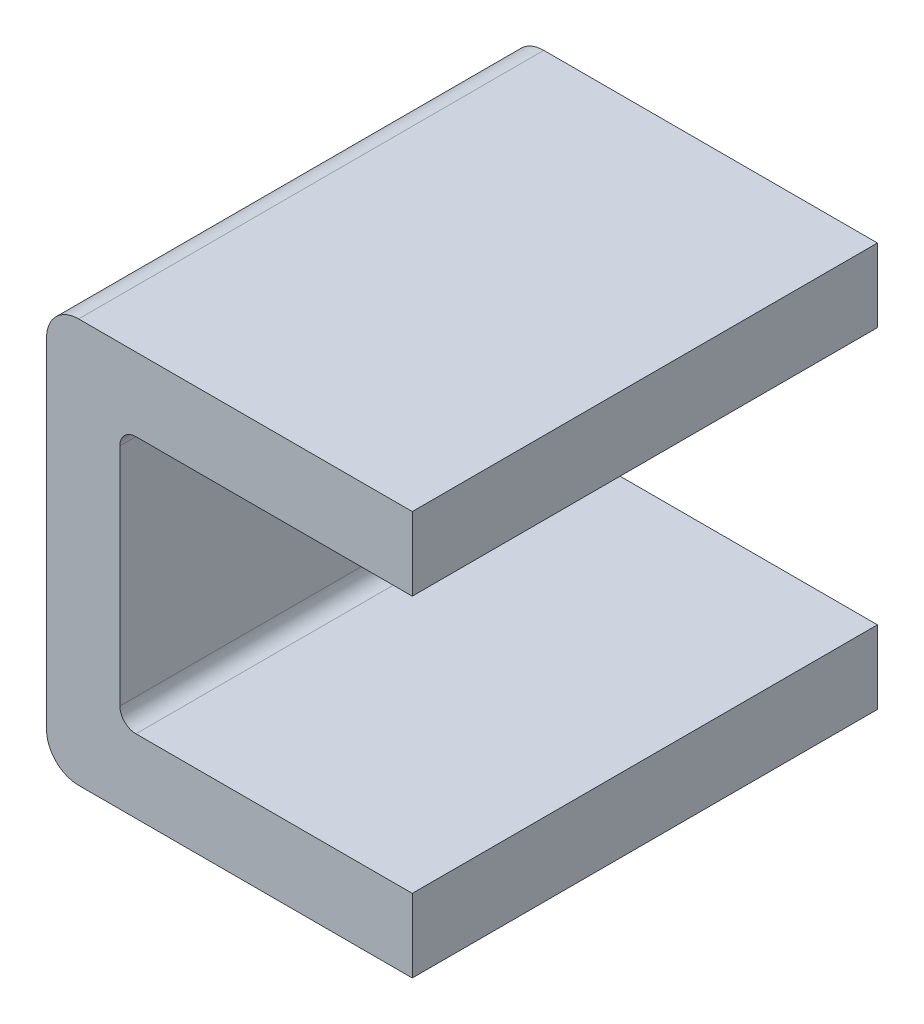
ISO-10303-21;
HEADER;
FILE_DESCRIPTION(('STEP AP214'),'2;1');
FILE_NAME('part.step','',(''),(''),'','','');
FILE_SCHEMA(('AUTOMOTIVE_DESIGN { 1 0 10303 214 1 1 1 1 }'));
ENDSEC;
DATA;
#1=APPLICATION_CONTEXT('core data for automotive mechanical design processes');
#2=APPLICATION_PROTOCOL_DEFINITION('international standard','automotive_design',2000,#1);
#3=PRODUCT_CONTEXT('',#1,'mechanical');
#4=PRODUCT('Part','Part','',(#3));
#5=PRODUCT_RELATED_PRODUCT_CATEGORY('part','',(#4));
#6=PRODUCT_DEFINITION_FORMATION('','',#4);
#7=PRODUCT_DEFINITION_CONTEXT('part definition',#1,'design');
#8=PRODUCT_DEFINITION('design','',#6,#7);
#9=PRODUCT_DEFINITION_SHAPE('','',#8);
#10=(LENGTH_UNIT() NAMED_UNIT(*) SI_UNIT(.MILLI.,.METRE.));
#11=(NAMED_UNIT(*) PLANE_ANGLE_UNIT() SI_UNIT($,.RADIAN.));
#12=(NAMED_UNIT(*) SI_UNIT($,.STERADIAN.) SOLID_ANGLE_UNIT());
#13=UNCERTAINTY_MEASURE_WITH_UNIT(LENGTH_MEASURE(1.E-05),#10,'distance_accuracy_value','');
#14=(GEOMETRIC_REPRESENTATION_CONTEXT(3) GLOBAL_UNCERTAINTY_ASSIGNED_CONTEXT((#13)) GLOBAL_UNIT_ASSIGNED_CONTEXT((#10,
#11,#12)) REPRESENTATION_CONTEXT('',''));
#15=CARTESIAN_POINT('',(0.,0.,0.));
#16=DIRECTION('',(0.,0.,1.));
#17=DIRECTION('',(1.,0.,0.));
#18=AXIS2_PLACEMENT_3D('',#15,#16,#17);
#19=CARTESIAN_POINT('',(0.0500000000000001,1.07149999997381,0.));
#20=DIRECTION('',(0.,0.,1.));
#21=DIRECTION('',(-0.707106781186547,0.707106781186548,0.));
#22=AXIS2_PLACEMENT_3D('',#19,#20,#21);
#23=CYLINDRICAL_SURFACE('',#22,0.05);
#24=CARTESIAN_POINT('',(0.0500000000000001,1.07149999997381,0.));
#25=DIRECTION('',(0.,0.,-1.));
#26=DIRECTION('',(-1.,0.,0.));
#27=AXIS2_PLACEMENT_3D('',#24,#25,#26);
#28=CIRCLE('',#27,0.05);
#29=CARTESIAN_POINT('',(0.,1.07149999997381,0.));
#30=VERTEX_POINT('',#29);
#31=CARTESIAN_POINT('',(0.0500000000000001,1.12149999997381,0.));
#32=VERTEX_POINT('',#31);
#33=EDGE_CURVE('E11',#30,#32,#28,.T.);
#34=ORIENTED_EDGE('',*,*,#33,.T.);
#35=DIRECTION('',(0.,0.,1.));
#36=VECTOR('',#35,1.);
#37=CARTESIAN_POINT('',(0.0500000000000001,1.12149999997381,0.));
#38=LINE('',#37,#36);
#39=CARTESIAN_POINT('',(0.0500000000000001,1.12149999997381,1.45));
#40=VERTEX_POINT('',#39);
#41=EDGE_CURVE('E24',#32,#40,#38,.T.);
#42=ORIENTED_EDGE('',*,*,#41,.T.);
#43=CARTESIAN_POINT('',(0.0500000000000001,1.07149999997381,1.45));
#44=DIRECTION('',(0.,0.,1.));
#45=DIRECTION('',(0.,1.,0.));
#46=AXIS2_PLACEMENT_3D('',#43,#44,#45);
#47=CIRCLE('',#46,0.05);
#48=CARTESIAN_POINT('',(0.,1.07149999997381,1.45));
#49=VERTEX_POINT('',#48);
#50=EDGE_CURVE('E182',#40,#49,#47,.T.);
#51=ORIENTED_EDGE('',*,*,#50,.T.);
#52=DIRECTION('',(0.,0.,-1.));
#53=VECTOR('',#52,1.);
#54=CARTESIAN_POINT('',(0.,1.07149999997381,1.45));
#55=LINE('',#54,#53);
#56=EDGE_CURVE('E180',#49,#30,#55,.T.);
#57=ORIENTED_EDGE('',*,*,#56,.T.);
#58=EDGE_LOOP('',(#34,#42,#51,#57));
#59=FACE_BOUND('',#58,.T.);
#60=ADVANCED_FACE('F17',(#59),#23,.F.);
#61=CARTESIAN_POINT('',(0.,1.12149999997381,0.));
#62=DIRECTION('',(0.,-1.,0.));
#63=DIRECTION('',(1.,0.,0.));
#64=AXIS2_PLACEMENT_3D('',#61,#62,#63);
#65=PLANE('',#64);
#66=ORIENTED_EDGE('',*,*,#41,.F.);
#67=DIRECTION('',(1.,0.,0.));
#68=VECTOR('',#67,1.);
#69=CARTESIAN_POINT('',(0.0500000000000001,1.12149999997381,0.));
#70=LINE('',#69,#68);
#71=CARTESIAN_POINT('',(0.9115,1.12149999997381,0.));
#72=VERTEX_POINT('',#71);
#73=EDGE_CURVE('E184',#32,#72,#70,.T.);
#74=ORIENTED_EDGE('',*,*,#73,.T.);
#75=DIRECTION('',(0.,0.,1.));
#76=VECTOR('',#75,1.);
#77=CARTESIAN_POINT('',(0.9115,1.12149999997381,0.));
#78=LINE('',#77,#76);
#79=CARTESIAN_POINT('',(0.9115,1.12149999997381,1.45));
#80=VERTEX_POINT('',#79);
#81=EDGE_CURVE('E176',#72,#80,#78,.T.);
#82=ORIENTED_EDGE('',*,*,#81,.T.);
#83=DIRECTION('',(1.,0.,0.));
#84=VECTOR('',#83,1.);
#85=CARTESIAN_POINT('',(0.0500000000000001,1.12149999997381,1.45));
#86=LINE('',#85,#84);
#87=EDGE_CURVE('E166',#40,#80,#86,.T.);
#88=ORIENTED_EDGE('',*,*,#87,.F.);
#89=EDGE_LOOP('',(#66,#74,#82,#88));
#90=FACE_BOUND('',#89,.T.);
#91=ADVANCED_FACE('F203',(#90),#65,.T.);
#92=CARTESIAN_POINT('',(0.0500000000000003,0.369249999973806,0.));
#93=DIRECTION('',(0.,0.,1.));
#94=DIRECTION('',(-0.707106781186547,-0.707106781186548,0.));
#95=AXIS2_PLACEMENT_3D('',#92,#93,#94);
#96=CYLINDRICAL_SURFACE('',#95,0.05);
#97=CARTESIAN_POINT('',(0.0500000000000003,0.369249999973806,0.));
#98=DIRECTION('',(0.,0.,-1.));
#99=DIRECTION('',(0.,-1.,0.));
#100=AXIS2_PLACEMENT_3D('',#97,#98,#99);
#101=CIRCLE('',#100,0.05);
#102=CARTESIAN_POINT('',(0.0500000000000003,0.319249999973806,0.));
#103=VERTEX_POINT('',#102);
#104=CARTESIAN_POINT('',(0.,0.369249999973806,0.));
#105=VERTEX_POINT('',#104);
#106=EDGE_CURVE('E186',#103,#105,#101,.T.);
#107=ORIENTED_EDGE('',*,*,#106,.T.);
#108=DIRECTION('',(0.,0.,1.));
#109=VECTOR('',#108,1.);
#110=CARTESIAN_POINT('',(0.,0.369249999973806,0.));
#111=LINE('',#110,#109);
#112=CARTESIAN_POINT('',(0.,0.369249999973806,1.45));
#113=VERTEX_POINT('',#112);
#114=EDGE_CURVE('E178',#105,#113,#111,.T.);
#115=ORIENTED_EDGE('',*,*,#114,.T.);
#116=CARTESIAN_POINT('',(0.0500000000000003,0.369249999973806,1.45));
#117=DIRECTION('',(0.,0.,1.));
#118=DIRECTION('',(-1.,0.,0.));
#119=AXIS2_PLACEMENT_3D('',#116,#117,#118);
#120=CIRCLE('',#119,0.05);
#121=CARTESIAN_POINT('',(0.0500000000000003,0.319249999973806,1.45));
#122=VERTEX_POINT('',#121);
#123=EDGE_CURVE('E169',#113,#122,#120,.T.);
#124=ORIENTED_EDGE('',*,*,#123,.T.);
#125=DIRECTION('',(0.,0.,-1.));
#126=VECTOR('',#125,1.);
#127=CARTESIAN_POINT('',(0.0500000000000003,0.319249999973806,1.45));
#128=LINE('',#127,#126);
#129=EDGE_CURVE('E162',#122,#103,#128,.T.);
#130=ORIENTED_EDGE('',*,*,#129,.T.);
#131=EDGE_LOOP('',(#107,#115,#124,#130));
#132=FACE_BOUND('',#131,.T.);
#133=ADVANCED_FACE('F189',(#132),#96,.F.);
#134=CARTESIAN_POINT('',(0.,0.0907499999738064,0.));
#135=DIRECTION('',(1.,0.,0.));
#136=DIRECTION('',(0.,1.,0.));
#137=AXIS2_PLACEMENT_3D('',#134,#135,#136);
#138=PLANE('',#137);
#139=ORIENTED_EDGE('',*,*,#56,.F.);
#140=DIRECTION('',(0.,1.,0.));
#141=VECTOR('',#140,1.);
#142=CARTESIAN_POINT('',(0.,0.369249999973806,1.45));
#143=LINE('',#142,#141);
#144=EDGE_CURVE('E171',#113,#49,#143,.T.);
#145=ORIENTED_EDGE('',*,*,#144,.F.);
#146=ORIENTED_EDGE('',*,*,#114,.F.);
#147=DIRECTION('',(0.,1.,0.));
#148=VECTOR('',#147,1.);
#149=CARTESIAN_POINT('',(0.,0.369249999973806,0.));
#150=LINE('',#149,#148);
#151=EDGE_CURVE('E151',#105,#30,#150,.T.);
#152=ORIENTED_EDGE('',*,*,#151,.T.);
#153=EDGE_LOOP('',(#139,#145,#146,#152));
#154=FACE_BOUND('',#153,.T.);
#155=ADVANCED_FACE('F195',(#154),#138,.T.);
#156=CARTESIAN_POINT('',(-0.1285,1.24999999997381,0.));
#157=DIRECTION('',(0.,0.,1.));
#158=DIRECTION('',(-0.707106781186547,0.707106781186548,0.));
#159=AXIS2_PLACEMENT_3D('',#156,#157,#158);
#160=CYLINDRICAL_SURFACE('',#159,0.1);
#161=CARTESIAN_POINT('',(-0.1285,1.24999999997381,1.45));
#162=DIRECTION('',(0.,0.,-1.));
#163=DIRECTION('',(-1.,0.,0.));
#164=AXIS2_PLACEMENT_3D('',#161,#162,#163);
#165=CIRCLE('',#164,0.1);
#166=CARTESIAN_POINT('',(-0.2285,1.24999999997381,1.45));
#167=VERTEX_POINT('',#166);
#168=CARTESIAN_POINT('',(-0.1285,1.34999999997381,1.45));
#169=VERTEX_POINT('',#168);
#170=EDGE_CURVE('E174',#167,#169,#165,.T.);
#171=ORIENTED_EDGE('',*,*,#170,.T.);
#172=DIRECTION('',(0.,0.,-1.));
#173=VECTOR('',#172,1.);
#174=CARTESIAN_POINT('',(-0.1285,1.34999999997381,1.45));
#175=LINE('',#174,#173);
#176=CARTESIAN_POINT('',(-0.1285,1.34999999997381,0.));
#177=VERTEX_POINT('',#176);
#178=EDGE_CURVE('E164',#169,#177,#175,.T.);
#179=ORIENTED_EDGE('',*,*,#178,.T.);
#180=CARTESIAN_POINT('',(-0.1285,1.24999999997381,0.));
#181=DIRECTION('',(0.,0.,1.));
#182=DIRECTION('',(0.,1.,0.));
#183=AXIS2_PLACEMENT_3D('',#180,#181,#182);
#184=CIRCLE('',#183,0.1);
#185=CARTESIAN_POINT('',(-0.2285,1.24999999997381,0.));
#186=VERTEX_POINT('',#185);
#187=EDGE_CURVE('E154',#177,#186,#184,.T.);
#188=ORIENTED_EDGE('',*,*,#187,.T.);
#189=DIRECTION('',(0.,0.,1.));
#190=VECTOR('',#189,1.);
#191=CARTESIAN_POINT('',(-0.2285,1.24999999997381,0.));
#192=LINE('',#191,#190);
#193=EDGE_CURVE('E159',#186,#167,#192,.T.);
#194=ORIENTED_EDGE('',*,*,#193,.T.);
#195=EDGE_LOOP('',(#171,#179,#188,#194));
#196=FACE_BOUND('',#195,.T.);
#197=ADVANCED_FACE('F224',(#196),#160,.T.);
#198=CARTESIAN_POINT('',(-0.11425,0.720374999973806,1.45));
#199=DIRECTION('',(0.,0.,1.));
#200=DIRECTION('',(1.,0.,0.));
#201=AXIS2_PLACEMENT_3D('',#198,#199,#200);
#202=PLANE('',#201);
#203=ORIENTED_EDGE('',*,*,#170,.F.);
#204=DIRECTION('',(0.,-1.,0.));
#205=VECTOR('',#204,1.);
#206=CARTESIAN_POINT('',(-0.2285,1.24999999997381,1.45));
#207=LINE('',#206,#205);
#208=CARTESIAN_POINT('',(-0.2285,0.190749999973806,1.45));
#209=VERTEX_POINT('',#208);
#210=EDGE_CURVE('E157',#167,#209,#207,.T.);
#211=ORIENTED_EDGE('',*,*,#210,.T.);
#212=CARTESIAN_POINT('',(-0.1285,0.190749999973806,1.45));
#213=DIRECTION('',(0.,0.,-1.));
#214=DIRECTION('',(0.,-1.,0.));
#215=AXIS2_PLACEMENT_3D('',#212,#213,#214);
#216=CIRCLE('',#215,0.1);
#217=CARTESIAN_POINT('',(-0.1285,0.0907499999738063,1.45));
#218=VERTEX_POINT('',#217);
#219=EDGE_CURVE('E148',#218,#209,#216,.T.);
#220=ORIENTED_EDGE('',*,*,#219,.F.);
#221=DIRECTION('',(1.,0.,0.));
#222=VECTOR('',#221,1.);
#223=CARTESIAN_POINT('',(-0.1285,0.0907499999738063,1.45));
#224=LINE('',#223,#222);
#225=CARTESIAN_POINT('',(0.9115,0.0907499999738063,1.45));
#226=VERTEX_POINT('',#225);
#227=EDGE_CURVE('E141',#218,#226,#224,.T.);
#228=ORIENTED_EDGE('',*,*,#227,.T.);
#229=DIRECTION('',(0.,1.,0.));
#230=VECTOR('',#229,1.);
#231=CARTESIAN_POINT('',(0.9115,0.0907499999738063,1.45));
#232=LINE('',#231,#230);
#233=CARTESIAN_POINT('',(0.9115,0.319249999973806,1.45));
#234=VERTEX_POINT('',#233);
#235=EDGE_CURVE('E120',#226,#234,#232,.T.);
#236=ORIENTED_EDGE('',*,*,#235,.T.);
#237=DIRECTION('',(-1.,0.,0.));
#238=VECTOR('',#237,1.);
#239=CARTESIAN_POINT('',(0.9115,0.319249999973806,1.45));
#240=LINE('',#239,#238);
#241=EDGE_CURVE('E128',#234,#122,#240,.T.);
#242=ORIENTED_EDGE('',*,*,#241,.T.);
#243=ORIENTED_EDGE('',*,*,#123,.F.);
#244=ORIENTED_EDGE('',*,*,#144,.T.);
#245=ORIENTED_EDGE('',*,*,#50,.F.);
#246=ORIENTED_EDGE('',*,*,#87,.T.);
#247=DIRECTION('',(0.,1.,0.));
#248=VECTOR('',#247,1.);
#249=CARTESIAN_POINT('',(0.9115,1.12149999997381,1.45));
#250=LINE('',#249,#248);
#251=CARTESIAN_POINT('',(0.9115,1.34999999997381,1.45));
#252=VERTEX_POINT('',#251);
#253=EDGE_CURVE('E121',#80,#252,#250,.T.);
#254=ORIENTED_EDGE('',*,*,#253,.T.);
#255=DIRECTION('',(-1.,0.,0.));
#256=VECTOR('',#255,1.);
#257=CARTESIAN_POINT('',(0.9115,1.34999999997381,1.45));
#258=LINE('',#257,#256);
#259=EDGE_CURVE('E138',#252,#169,#258,.T.);
#260=ORIENTED_EDGE('',*,*,#259,.T.);
#261=EDGE_LOOP('',(#203,#211,#220,#228,#236,#242,#243,#244,#245,#246,#254,#260));
#262=FACE_BOUND('',#261,.T.);
#263=ADVANCED_FACE('F208',(#262),#202,.T.);
#264=CARTESIAN_POINT('',(-0.2285,0.319249999973806,0.));
#265=DIRECTION('',(-1.,0.,0.));
#266=DIRECTION('',(0.,-1.,0.));
#267=AXIS2_PLACEMENT_3D('',#264,#265,#266);
#268=PLANE('',#267);
#269=ORIENTED_EDGE('',*,*,#193,.F.);
#270=DIRECTION('',(0.,-1.,0.));
#271=VECTOR('',#270,1.);
#272=CARTESIAN_POINT('',(-0.2285,1.24999999997381,0.));
#273=LINE('',#272,#271);
#274=CARTESIAN_POINT('',(-0.2285,0.190749999973806,0.));
#275=VERTEX_POINT('',#274);
#276=EDGE_CURVE('E146',#186,#275,#273,.T.);
#277=ORIENTED_EDGE('',*,*,#276,.T.);
#278=DIRECTION('',(0.,0.,-1.));
#279=VECTOR('',#278,1.);
#280=CARTESIAN_POINT('',(-0.2285,0.190749999973806,1.45));
#281=LINE('',#280,#279);
#282=EDGE_CURVE('E143',#209,#275,#281,.T.);
#283=ORIENTED_EDGE('',*,*,#282,.F.);
#284=ORIENTED_EDGE('',*,*,#210,.F.);
#285=EDGE_LOOP('',(#269,#277,#283,#284));
#286=FACE_BOUND('',#285,.T.);
#287=ADVANCED_FACE('F227',(#286),#268,.T.);
#288=CARTESIAN_POINT('',(-0.1285,0.190749999973806,0.));
#289=DIRECTION('',(0.,0.,1.));
#290=DIRECTION('',(-0.707106781186548,-0.707106781186548,0.));
#291=AXIS2_PLACEMENT_3D('',#288,#289,#290);
#292=CYLINDRICAL_SURFACE('',#291,0.1);
#293=ORIENTED_EDGE('',*,*,#219,.T.);
#294=ORIENTED_EDGE('',*,*,#282,.T.);
#295=CARTESIAN_POINT('',(-0.1285,0.190749999973806,0.));
#296=DIRECTION('',(0.,0.,1.));
#297=DIRECTION('',(-1.,0.,0.));
#298=AXIS2_PLACEMENT_3D('',#295,#296,#297);
#299=CIRCLE('',#298,0.1);
#300=CARTESIAN_POINT('',(-0.1285,0.0907499999738063,0.));
#301=VERTEX_POINT('',#300);
#302=EDGE_CURVE('E130',#275,#301,#299,.T.);
#303=ORIENTED_EDGE('',*,*,#302,.T.);
#304=DIRECTION('',(0.,0.,1.));
#305=VECTOR('',#304,1.);
#306=CARTESIAN_POINT('',(-0.1285,0.0907499999738063,0.));
#307=LINE('',#306,#305);
#308=EDGE_CURVE('E107',#301,#218,#307,.T.);
#309=ORIENTED_EDGE('',*,*,#308,.T.);
#310=EDGE_LOOP('',(#293,#294,#303,#309));
#311=FACE_BOUND('',#310,.T.);
#312=ADVANCED_FACE('F236',(#311),#292,.T.);
#313=CARTESIAN_POINT('',(0.,1.34999999997381,0.));
#314=DIRECTION('',(0.,1.,0.));
#315=DIRECTION('',(-1.,0.,0.));
#316=AXIS2_PLACEMENT_3D('',#313,#314,#315);
#317=PLANE('',#316);
#318=ORIENTED_EDGE('',*,*,#178,.F.);
#319=ORIENTED_EDGE('',*,*,#259,.F.);
#320=DIRECTION('',(0.,0.,1.));
#321=VECTOR('',#320,1.);
#322=CARTESIAN_POINT('',(0.9115,1.34999999997381,0.));
#323=LINE('',#322,#321);
#324=CARTESIAN_POINT('',(0.9115,1.34999999997381,0.));
#325=VERTEX_POINT('',#324);
#326=EDGE_CURVE('E133',#325,#252,#323,.T.);
#327=ORIENTED_EDGE('',*,*,#326,.F.);
#328=DIRECTION('',(-1.,0.,0.));
#329=VECTOR('',#328,1.);
#330=CARTESIAN_POINT('',(0.9115,1.34999999997381,0.));
#331=LINE('',#330,#329);
#332=EDGE_CURVE('E374',#325,#177,#331,.T.);
#333=ORIENTED_EDGE('',*,*,#332,.T.);
#334=EDGE_LOOP('',(#318,#319,#327,#333));
#335=FACE_BOUND('',#334,.T.);
#336=ADVANCED_FACE('F238',(#335),#317,.T.);
#337=CARTESIAN_POINT('',(0.9115,0.319249999973806,0.));
#338=DIRECTION('',(0.,1.,0.));
#339=DIRECTION('',(-1.,0.,0.));
#340=AXIS2_PLACEMENT_3D('',#337,#338,#339);
#341=PLANE('',#340);
#342=ORIENTED_EDGE('',*,*,#129,.F.);
#343=ORIENTED_EDGE('',*,*,#241,.F.);
#344=DIRECTION('',(0.,0.,1.));
#345=VECTOR('',#344,1.);
#346=CARTESIAN_POINT('',(0.9115,0.319249999973806,0.));
#347=LINE('',#346,#345);
#348=CARTESIAN_POINT('',(0.9115,0.319249999973806,0.));
#349=VERTEX_POINT('',#348);
#350=EDGE_CURVE('E377',#349,#234,#347,.T.);
#351=ORIENTED_EDGE('',*,*,#350,.F.);
#352=DIRECTION('',(-1.,0.,0.));
#353=VECTOR('',#352,1.);
#354=CARTESIAN_POINT('',(0.9115,0.319249999973806,0.));
#355=LINE('',#354,#353);
#356=EDGE_CURVE('E112',#349,#103,#355,.T.);
#357=ORIENTED_EDGE('',*,*,#356,.T.);
#358=EDGE_LOOP('',(#342,#343,#351,#357));
#359=FACE_BOUND('',#358,.T.);
#360=ADVANCED_FACE('F241',(#359),#341,.T.);
#361=CARTESIAN_POINT('',(0.9115,0.0907499999738063,0.));
#362=DIRECTION('',(1.,0.,0.));
#363=DIRECTION('',(0.,1.,0.));
#364=AXIS2_PLACEMENT_3D('',#361,#362,#363);
#365=PLANE('',#364);
#366=DIRECTION('',(0.,1.,0.));
#367=VECTOR('',#366,1.);
#368=CARTESIAN_POINT('',(0.9115,0.0907499999738063,0.));
#369=LINE('',#368,#367);
#370=CARTESIAN_POINT('',(0.9115,0.0907499999738063,0.));
#371=VERTEX_POINT('',#370);
#372=EDGE_CURVE('E118',#371,#349,#369,.T.);
#373=ORIENTED_EDGE('',*,*,#372,.T.);
#374=ORIENTED_EDGE('',*,*,#350,.T.);
#375=ORIENTED_EDGE('',*,*,#235,.F.);
#376=DIRECTION('',(0.,0.,1.));
#377=VECTOR('',#376,1.);
#378=CARTESIAN_POINT('',(0.9115,0.0907499999738063,0.));
#379=LINE('',#378,#377);
#380=EDGE_CURVE('E105',#371,#226,#379,.T.);
#381=ORIENTED_EDGE('',*,*,#380,.F.);
#382=EDGE_LOOP('',(#373,#374,#375,#381));
#383=FACE_BOUND('',#382,.T.);
#384=ADVANCED_FACE('F116',(#383),#365,.T.);
#385=CARTESIAN_POINT('',(-0.2285,0.0907499999738063,0.));
#386=DIRECTION('',(0.,-1.,0.));
#387=DIRECTION('',(1.,0.,0.));
#388=AXIS2_PLACEMENT_3D('',#385,#386,#387);
#389=PLANE('',#388);
#390=ORIENTED_EDGE('',*,*,#308,.F.);
#391=DIRECTION('',(1.,0.,0.));
#392=VECTOR('',#391,1.);
#393=CARTESIAN_POINT('',(-0.1285,0.0907499999738063,0.));
#394=LINE('',#393,#392);
#395=EDGE_CURVE('E101',#301,#371,#394,.T.);
#396=ORIENTED_EDGE('',*,*,#395,.T.);
#397=ORIENTED_EDGE('',*,*,#380,.T.);
#398=ORIENTED_EDGE('',*,*,#227,.F.);
#399=EDGE_LOOP('',(#390,#396,#397,#398));
#400=FACE_BOUND('',#399,.T.);
#401=ADVANCED_FACE('F103',(#400),#389,.T.);
#402=CARTESIAN_POINT('',(0.9115,1.12149999997381,0.));
#403=DIRECTION('',(1.,0.,0.));
#404=DIRECTION('',(0.,1.,0.));
#405=AXIS2_PLACEMENT_3D('',#402,#403,#404);
#406=PLANE('',#405);
#407=DIRECTION('',(0.,1.,0.));
#408=VECTOR('',#407,1.);
#409=CARTESIAN_POINT('',(0.9115,1.12149999997381,0.));
#410=LINE('',#409,#408);
#411=EDGE_CURVE('E111',#72,#325,#410,.T.);
#412=ORIENTED_EDGE('',*,*,#411,.T.);
#413=ORIENTED_EDGE('',*,*,#326,.T.);
#414=ORIENTED_EDGE('',*,*,#253,.F.);
#415=ORIENTED_EDGE('',*,*,#81,.F.);
#416=EDGE_LOOP('',(#412,#413,#414,#415));
#417=FACE_BOUND('',#416,.T.);
#418=ADVANCED_FACE('F220',(#417),#406,.T.);
#419=CARTESIAN_POINT('',(0.45575,1.23574999997381,0.));
#420=DIRECTION('',(0.,0.,1.));
#421=DIRECTION('',(1.,0.,0.));
#422=AXIS2_PLACEMENT_3D('',#419,#420,#421);
#423=PLANE('',#422);
#424=ORIENTED_EDGE('',*,*,#187,.F.);
#425=ORIENTED_EDGE('',*,*,#332,.F.);
#426=ORIENTED_EDGE('',*,*,#411,.F.);
#427=ORIENTED_EDGE('',*,*,#73,.F.);
#428=ORIENTED_EDGE('',*,*,#33,.F.);
#429=ORIENTED_EDGE('',*,*,#151,.F.);
#430=ORIENTED_EDGE('',*,*,#106,.F.);
#431=ORIENTED_EDGE('',*,*,#356,.F.);
#432=ORIENTED_EDGE('',*,*,#372,.F.);
#433=ORIENTED_EDGE('',*,*,#395,.F.);
#434=ORIENTED_EDGE('',*,*,#302,.F.);
#435=ORIENTED_EDGE('',*,*,#276,.F.);
#436=EDGE_LOOP('',(#424,#425,#426,#427,#428,#429,#430,#431,#432,#433,#434,#435));
#437=FACE_BOUND('',#436,.T.);
#438=ADVANCED_FACE('F125',(#437),#423,.F.);
#439=CLOSED_SHELL('',(#60,#91,#133,#155,#197,#263,#287,#312,#336,#360,#384,#401,#418,#438));
#440=MANIFOLD_SOLID_BREP('B1',#439);
#441=ADVANCED_BREP_SHAPE_REPRESENTATION('',(#18,#440),#14);
#442=SHAPE_DEFINITION_REPRESENTATION(#9,#441);
ENDSEC;
END-ISO-10303-21;
